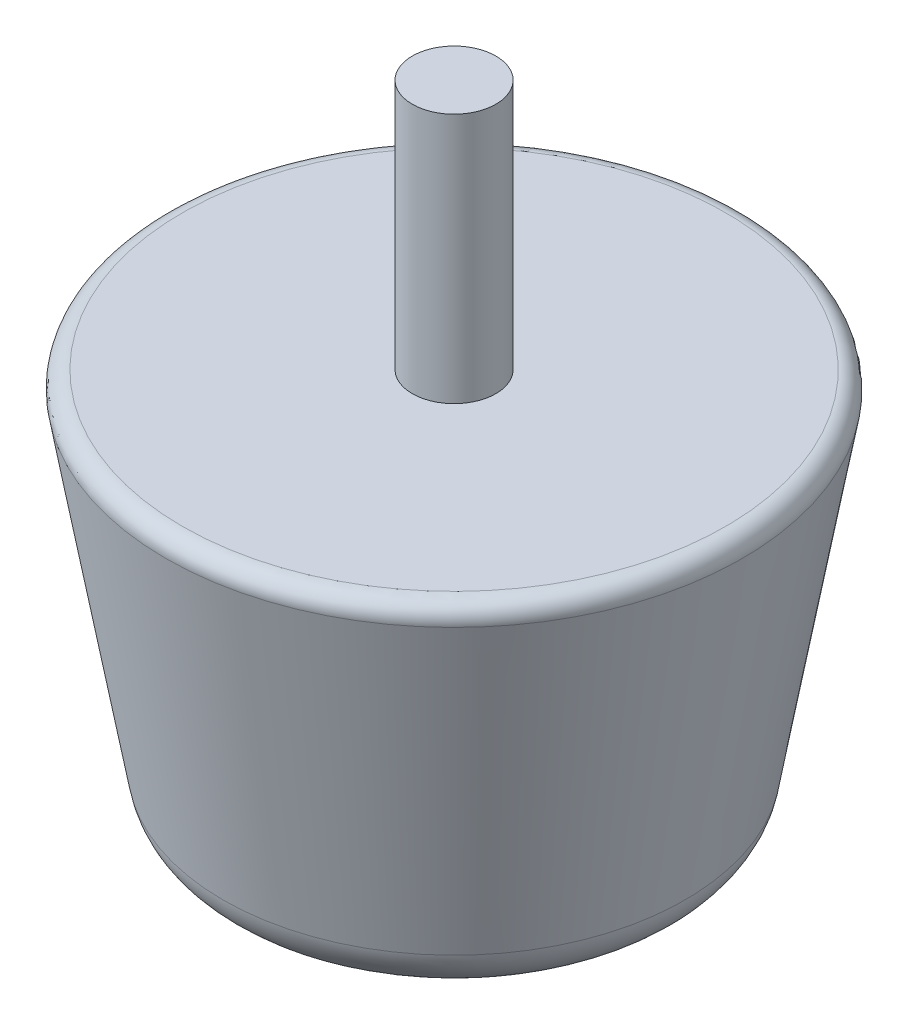
ISO-10303-21;
HEADER;
FILE_DESCRIPTION(('STEP AP214'),'2;1');
FILE_NAME('part.step','',(''),(''),'','','');
FILE_SCHEMA(('AUTOMOTIVE_DESIGN { 1 0 10303 214 1 1 1 1 }'));
ENDSEC;
DATA;
#1=APPLICATION_CONTEXT('core data for automotive mechanical design processes');
#2=APPLICATION_PROTOCOL_DEFINITION('international standard','automotive_design',2000,#1);
#3=PRODUCT_CONTEXT('',#1,'mechanical');
#4=PRODUCT('Part','Part','',(#3));
#5=PRODUCT_RELATED_PRODUCT_CATEGORY('part','',(#4));
#6=PRODUCT_DEFINITION_FORMATION('','',#4);
#7=PRODUCT_DEFINITION_CONTEXT('part definition',#1,'design');
#8=PRODUCT_DEFINITION('design','',#6,#7);
#9=PRODUCT_DEFINITION_SHAPE('','',#8);
#10=(LENGTH_UNIT() NAMED_UNIT(*) SI_UNIT(.MILLI.,.METRE.));
#11=(NAMED_UNIT(*) PLANE_ANGLE_UNIT() SI_UNIT($,.RADIAN.));
#12=(NAMED_UNIT(*) SI_UNIT($,.STERADIAN.) SOLID_ANGLE_UNIT());
#13=UNCERTAINTY_MEASURE_WITH_UNIT(LENGTH_MEASURE(1.E-05),#10,'distance_accuracy_value','');
#14=(GEOMETRIC_REPRESENTATION_CONTEXT(3) GLOBAL_UNCERTAINTY_ASSIGNED_CONTEXT((#13)) GLOBAL_UNIT_ASSIGNED_CONTEXT((#10,
#11,#12)) REPRESENTATION_CONTEXT('',''));
#15=CARTESIAN_POINT('',(0.,0.,0.));
#16=DIRECTION('',(0.,0.,1.));
#17=DIRECTION('',(1.,0.,0.));
#18=AXIS2_PLACEMENT_3D('',#15,#16,#17);
#19=CARTESIAN_POINT('',(0.,0.,0.));
#20=DIRECTION('',(0.,1.,0.));
#21=DIRECTION('',(0.,0.,1.));
#22=AXIS2_PLACEMENT_3D('',#19,#20,#21);
#23=CONICAL_SURFACE('',#22,40.,0.174532925199433);
#24=CARTESIAN_POINT('',(0.,66.4790554669992,0.));
#25=DIRECTION('',(0.,1.,0.));
#26=DIRECTION('',(0.,0.,1.));
#27=AXIS2_PLACEMENT_3D('',#24,#25,#26);
#28=CIRCLE('',#27,51.7220511308465);
#29=CARTESIAN_POINT('',(0.,66.4790554669992,51.7220511308465));
#30=VERTEX_POINT('',#29);
#31=EDGE_CURVE('E10',#30,#30,#28,.F.);
#32=ORIENTED_EDGE('',*,*,#31,.T.);
#33=EDGE_LOOP('',(#32));
#34=FACE_BOUND('',#33,.T.);
#35=CARTESIAN_POINT('',(0.,8.26351822333068,0.));
#36=DIRECTION('',(0.,-1.,0.));
#37=DIRECTION('',(0.,0.,-1.));
#38=AXIS2_PLACEMENT_3D('',#35,#36,#37);
#39=CIRCLE('',#38,41.4570812183493);
#40=CARTESIAN_POINT('',(0.,8.26351822333068,-41.4570812183493));
#41=VERTEX_POINT('',#40);
#42=EDGE_CURVE('E48',#41,#41,#39,.F.);
#43=ORIENTED_EDGE('',*,*,#42,.T.);
#44=EDGE_LOOP('',(#43));
#45=FACE_BOUND('',#44,.T.);
#46=CARTESIAN_POINT('',(-45.8974561002225,35.9488089682655,-6.37987512782607));
#47=CARTESIAN_POINT('',(-45.8903514142707,35.769928031762,-6.20189333521978));
#48=CARTESIAN_POINT('',(-45.8846228311216,35.5985513842555,-6.01639155035223));
#49=CARTESIAN_POINT('',(-45.8754159511401,35.2719126647508,-5.63155509444685));
#50=CARTESIAN_POINT('',(-45.8719381022997,35.1166538060377,-5.43221767826768));
#51=CARTESIAN_POINT('',(-45.8667348880702,34.8233154550655,-5.02101952539878));
#52=CARTESIAN_POINT('',(-45.8650109720066,34.6852502529545,-4.80914858460226));
#53=CARTESIAN_POINT('',(-45.8628353063316,34.4274271037308,-4.37453493287493));
#54=CARTESIAN_POINT('',(-45.8623835729308,34.3076693899172,-4.1517920834471));
#55=CARTESIAN_POINT('',(-45.8623017406117,34.0873766555292,-3.69714495858653));
#56=CARTESIAN_POINT('',(-45.8626711982514,33.9868312921531,-3.4652456940292));
#57=CARTESIAN_POINT('',(-45.8638314727603,33.8055935775401,-2.99381294864866));
#58=CARTESIAN_POINT('',(-45.8646222942675,33.7249014448443,-2.75427938382107));
#59=CARTESIAN_POINT('',(-45.8662905447548,33.5839691540764,-2.26936699004312));
#60=CARTESIAN_POINT('',(-45.8671679412458,33.5237213612054,-2.02399037985416));
#61=CARTESIAN_POINT('',(-45.8687522817933,33.4240449582834,-1.52895543413469));
#62=CARTESIAN_POINT('',(-45.8694591667411,33.3846235621911,-1.27929564585051));
#63=CARTESIAN_POINT('',(-45.8705307017393,33.3268565305042,-0.777070797355823));
#64=CARTESIAN_POINT('',(-45.870894703243,33.3085508195416,-0.524501142555404));
#65=CARTESIAN_POINT('',(-45.8711967935054,33.2932798876374,-0.0187168572044999));
#66=CARTESIAN_POINT('',(-45.8711348814271,33.2963147086415,0.234497774612731));
#67=CARTESIAN_POINT('',(-45.8705986726555,33.3237035949045,0.739776440757387));
#68=CARTESIAN_POINT('',(-45.8701243670717,33.3480581197884,0.991840450161136));
#69=CARTESIAN_POINT('',(-45.8688712984262,33.4179146705308,1.4930270841764));
#70=CARTESIAN_POINT('',(-45.8680925269878,33.4634172782382,1.74214962766575));
#71=CARTESIAN_POINT('',(-45.8664293022167,33.5752414004759,2.23565268716838));
#72=CARTESIAN_POINT('',(-45.8655448587494,33.6415609724955,2.48003364337901));
#73=CARTESIAN_POINT('',(-45.8639527494806,33.7945470795368,2.96233454989759));
#74=CARTESIAN_POINT('',(-45.8632450786204,33.8812130321593,3.20025468492405));
#75=CARTESIAN_POINT('',(-45.8623629587414,34.0742804763686,3.6679581195617));
#76=CARTESIAN_POINT('',(-45.8621885265835,34.1806825918921,3.89774116165422));
#77=CARTESIAN_POINT('',(-45.8627909109035,34.4124632122493,4.34752663878387));
#78=CARTESIAN_POINT('',(-45.863567723556,34.5378416407658,4.56752911315103));
#79=CARTESIAN_POINT('',(-45.866537048813,34.8066902088615,4.99620155158313));
#80=CARTESIAN_POINT('',(-45.8687296691272,34.9501617242307,5.2048706521354));
#81=CARTESIAN_POINT('',(-45.8750230378274,35.2541004204664,5.60928834527643));
#82=CARTESIAN_POINT('',(-45.8791230678286,35.4145611851385,5.80504177061001));
#83=CARTESIAN_POINT('',(-45.8897345720545,35.7513846507814,6.18233675634842));
#84=CARTESIAN_POINT('',(-45.8962464041637,35.9277497088315,6.36387620271218));
#85=CARTESIAN_POINT('',(-45.9121736731263,36.2950678213194,6.71140387256858));
#86=CARTESIAN_POINT('',(-45.9215890942489,36.4860207967202,6.87739218030616));
#87=CARTESIAN_POINT('',(-45.9437262707912,36.8800784158394,7.19181209453772));
#88=CARTESIAN_POINT('',(-45.9564307196313,37.0831152926141,7.34032985174292));
#89=CARTESIAN_POINT('',(-45.9855691556515,37.500717201811,7.61974747462699));
#90=CARTESIAN_POINT('',(-46.0020031276112,37.7152821871835,7.75064741220206));
#91=CARTESIAN_POINT('',(-46.0389280542005,38.1543183168253,7.99391591110991));
#92=CARTESIAN_POINT('',(-46.0594187167475,38.3787887469968,8.10628580554266));
#93=CARTESIAN_POINT('',(-46.104697622058,38.8359627595581,8.31175678427947));
#94=CARTESIAN_POINT('',(-46.129485847132,39.0686663080559,8.40485794789328));
#95=CARTESIAN_POINT('',(-46.1833148704562,39.5389674936952,8.57064876774292));
#96=CARTESIAN_POINT('',(-46.2123258414896,39.7765215055597,8.64347193022743));
#97=CARTESIAN_POINT('',(-46.2747490201945,40.2562869817818,8.76913524887538));
#98=CARTESIAN_POINT('',(-46.3081611993136,40.4984984159162,8.82197553466674));
#99=CARTESIAN_POINT('',(-46.3792954662731,40.9857938142128,8.90743523162322));
#100=CARTESIAN_POINT('',(-46.4170168658507,41.2308773140567,8.94005786659067));
#101=CARTESIAN_POINT('',(-46.4965921953376,41.7223204340153,8.98503559020163));
#102=CARTESIAN_POINT('',(-46.5384476686118,41.9686804979363,8.99738307901651));
#103=CARTESIAN_POINT('',(-46.6264142197458,42.463356203862,9.00189171154719));
#104=CARTESIAN_POINT('',(-46.6725635564519,42.7116668623964,8.99385042415932));
#105=CARTESIAN_POINT('',(-46.7683642977407,43.2061938886507,8.95737288395813));
#106=CARTESIAN_POINT('',(-46.8180169797143,43.4524094554056,8.92892915698891));
#107=CARTESIAN_POINT('',(-46.920297946936,43.9409984145933,8.85199475474628));
#108=CARTESIAN_POINT('',(-46.9729255675674,44.1833726498289,8.80350854190837));
#109=CARTESIAN_POINT('',(-47.0806102561915,44.6629011493776,8.68691849244843));
#110=CARTESIAN_POINT('',(-47.1356682470228,44.9000533787072,8.61880714873318));
#111=CARTESIAN_POINT('',(-47.2493059145538,45.3749118495865,8.46107903716087));
#112=CARTESIAN_POINT('',(-47.3079418781172,45.6124034953579,8.37085635953464));
#113=CARTESIAN_POINT('',(-47.4263630133958,46.0787865322759,8.17074786242679));
#114=CARTESIAN_POINT('',(-47.4861486994376,46.3076739323621,8.06085305098553));
#115=CARTESIAN_POINT('',(-47.6060466760404,46.7553320290342,7.82214745000627));
#116=CARTESIAN_POINT('',(-47.6661590258102,46.9741008182689,7.69333311310465));
#117=CARTESIAN_POINT('',(-47.785827834406,47.3999865747197,7.41767918119029));
#118=CARTESIAN_POINT('',(-47.8453845260436,47.6071086231341,7.27084753708598));
#119=CARTESIAN_POINT('',(-47.9645221424168,48.0133021727708,6.95624587621774));
#120=CARTESIAN_POINT('',(-48.0240689952911,48.2120589470591,6.78805621084002));
#121=CARTESIAN_POINT('',(-48.1407259564724,48.594557240679,6.43476563406044));
#122=CARTESIAN_POINT('',(-48.1978369983242,48.7783045376833,6.24967128852915));
#123=CARTESIAN_POINT('',(-48.3087180057107,49.1295590489613,5.86359571894525));
#124=CARTESIAN_POINT('',(-48.362486684683,49.2970600233344,5.66260844410238));
#125=CARTESIAN_POINT('',(-48.4656977304076,49.6143295779788,5.24618698162293));
#126=CARTESIAN_POINT('',(-48.5151419752442,49.7641058660889,5.03075913799497));
#127=CARTESIAN_POINT('',(-48.6079469712588,50.0420930477672,4.59097835659671));
#128=CARTESIAN_POINT('',(-48.6514042180443,50.1706549310639,4.36686774905923));
#129=CARTESIAN_POINT('',(-48.7324822169639,50.4083435473385,3.90767507600775));
#130=CARTESIAN_POINT('',(-48.7701055542724,50.517478891969,3.67259793050525));
#131=CARTESIAN_POINT('',(-48.8388053472719,50.7153299515976,3.1930990031879));
#132=CARTESIAN_POINT('',(-48.8698824467359,50.804047674594,2.9486781430525));
#133=CARTESIAN_POINT('',(-48.9248645719362,50.9601704515743,2.45233773444084));
#134=CARTESIAN_POINT('',(-48.9487699593866,51.027576580444,2.20041856485574));
#135=CARTESIAN_POINT('',(-48.9878413294669,51.1373552032242,1.70465712970986));
#136=CARTESIAN_POINT('',(-49.0034046456209,51.1808688700417,1.46109833134884));
#137=CARTESIAN_POINT('',(-49.0273561720327,51.247714322951,0.970879543670583));
#138=CARTESIAN_POINT('',(-49.035744648135,51.2710468568011,0.724219669599079));
#139=CARTESIAN_POINT('',(-49.0451813732922,51.2972891968117,0.229727200491343));
#140=CARTESIAN_POINT('',(-49.0462311296065,51.3002031966233,-0.0181051432736649));
#141=CARTESIAN_POINT('',(-49.0409735859176,51.2855892112619,-0.513086254831176));
#142=CARTESIAN_POINT('',(-49.0346664014755,51.2680615471815,-0.760235033299828));
#143=CARTESIAN_POINT('',(-49.0151773618636,51.2137429678976,-1.2431029992945));
#144=CARTESIAN_POINT('',(-49.002251018414,51.1776678239884,-1.47891347791836));
#145=CARTESIAN_POINT('',(-48.9699052235514,51.0870132318688,-1.94658293988985));
#146=CARTESIAN_POINT('',(-48.9504834697493,51.032427222127,-2.17844049139623));
#147=CARTESIAN_POINT('',(-48.9054947889027,50.9052615801361,-2.63650437545279));
#148=CARTESIAN_POINT('',(-48.8799289957146,50.8326852678431,-2.86271174222727));
#149=CARTESIAN_POINT('',(-48.8230869333507,50.6701610901623,-3.30806375305191));
#150=CARTESIAN_POINT('',(-48.7918103637822,50.5802123109503,-3.5272080248622));
#151=CARTESIAN_POINT('',(-48.7235320024675,50.3821420973028,-3.96044453804275));
#152=CARTESIAN_POINT('',(-48.6864480517543,50.2737575807988,-4.17440349008854));
#153=CARTESIAN_POINT('',(-48.6075286705465,50.0406968583459,-4.59233719419268));
#154=CARTESIAN_POINT('',(-48.5656931030421,49.9160201826074,-4.79631165811184));
#155=CARTESIAN_POINT('',(-48.4779257318314,49.6513073550324,-5.1931048572222));
#156=CARTESIAN_POINT('',(-48.4319938667161,49.5112709729258,-5.38592342509996));
#157=CARTESIAN_POINT('',(-48.3367071054995,49.2167731217232,-5.75940721588838));
#158=CARTESIAN_POINT('',(-48.2873510614239,49.0623068088432,-5.94006832256637));
#159=CARTESIAN_POINT('',(-48.183355790846,48.7317986693752,-6.29707372339959));
#160=CARTESIAN_POINT('',(-48.1285755362986,48.5550591515626,-6.47273143245397));
#161=CARTESIAN_POINT('',(-48.0168586889689,48.188011872343,-6.80850087877895));
#162=CARTESIAN_POINT('',(-47.9599220073745,47.9977035518215,-6.96861197479491));
#163=CARTESIAN_POINT('',(-47.8446988617516,47.6046826719607,-7.27243190266121));
#164=CARTESIAN_POINT('',(-47.7864119077565,47.4019655646574,-7.41613466470374));
#165=CARTESIAN_POINT('',(-47.6693406645787,46.985520347603,-7.68619713508412));
#166=CARTESIAN_POINT('',(-47.6105565253775,46.771795465946,-7.81256188851263));
#167=CARTESIAN_POINT('',(-47.4908278486114,46.325498374722,-8.05211085189159));
#168=CARTESIAN_POINT('',(-47.4298949028055,46.0925120857474,-8.16453037397656));
#169=CARTESIAN_POINT('',(-47.3091846796956,45.6174750962189,-8.36899584095719));
#170=CARTESIAN_POINT('',(-47.2494074096512,45.3754243387534,-8.46104165791074));
#171=CARTESIAN_POINT('',(-47.1318124356856,44.8838511866916,-8.62405370578498));
#172=CARTESIAN_POINT('',(-47.0739947815839,44.6343286024416,-8.69501940113918));
#173=CARTESIAN_POINT('',(-46.9610653855728,44.1295143528488,-8.81524446585442));
#174=CARTESIAN_POINT('',(-46.9059535338164,43.8742229223184,-8.86450471703692));
#175=CARTESIAN_POINT('',(-46.7991933671373,43.3601065750519,-8.9407393706553));
#176=CARTESIAN_POINT('',(-46.7475389619368,43.101288892783,-8.96775396147848));
#177=CARTESIAN_POINT('',(-46.6481690353078,42.5816312165141,-8.99925612517496));
#178=CARTESIAN_POINT('',(-46.6004520195229,42.320792031234,-9.00375228350003));
#179=CARTESIAN_POINT('',(-46.5093806058819,41.7988916928987,-8.99000699668448));
#180=CARTESIAN_POINT('',(-46.4660270863931,41.5378305057779,-8.9717609834223));
#181=CARTESIAN_POINT('',(-46.3840255970083,41.0175687309552,-8.91246690466168));
#182=CARTESIAN_POINT('',(-46.3453774292039,40.7583680654309,-8.87141979858786));
#183=CARTESIAN_POINT('',(-46.2741480566061,40.2521915840902,-8.76835525547098));
#184=CARTESIAN_POINT('',(-46.2414113972634,40.0050910910807,-8.70705674700625));
#185=CARTESIAN_POINT('',(-46.1805768379421,39.5164586296844,-8.56355358463773));
#186=CARTESIAN_POINT('',(-46.1524787753533,39.2749264663503,-8.4813496638487));
#187=CARTESIAN_POINT('',(-46.1008707766185,38.7994978490752,-8.29661001764855));
#188=CARTESIAN_POINT('',(-46.0773568494005,38.5655949020311,-8.19409213636467));
#189=CARTESIAN_POINT('',(-46.0347028432187,38.1071000332473,-7.9694085924648));
#190=CARTESIAN_POINT('',(-46.0155618672502,37.8825062097183,-7.84724696806083));
#191=CARTESIAN_POINT('',(-45.9741891621458,37.3524567581588,-7.52892650761931));
#192=CARTESIAN_POINT('',(-45.9540194584909,37.0525221190408,-7.32320230470387));
#193=CARTESIAN_POINT('',(-45.9207676793008,36.4794759116237,-6.87680662681361));
#194=CARTESIAN_POINT('',(-45.9076855174557,36.2063640167188,-6.63613557745559));
#195=CARTESIAN_POINT('',(-45.8974561002225,35.9488089682655,-6.37987512782607));
#196=B_SPLINE_CURVE_WITH_KNOTS('',3,(#46,#47,#48,#49,#50,#51,#52,#53,#54,#55,#56,#57,#58,#59,
#60,#61,#62,#63,#64,#65,#66,#67,#68,#69,#70,#71,#72,#73,#74,#75,#76,#77,#78,#79,#80,#81,#82,#83,
#84,#85,#86,#87,#88,#89,#90,#91,#92,#93,#94,#95,#96,#97,#98,#99,#100,#101,#102,#103,#104,#105,
#106,#107,#108,#109,#110,#111,#112,#113,#114,#115,#116,#117,#118,#119,#120,#121,#122,#123,#124,
#125,#126,#127,#128,#129,#130,#131,#132,#133,#134,#135,#136,#137,#138,#139,#140,#141,#142,#143,
#144,#145,#146,#147,#148,#149,#150,#151,#152,#153,#154,#155,#156,#157,#158,#159,#160,#161,#162,
#163,#164,#165,#166,#167,#168,#169,#170,#171,#172,#173,#174,#175,#176,#177,#178,#179,#180,#181,
#182,#183,#184,#185,#186,#187,#188,#189,#190,#191,#192,#193,#194,#195),.UNSPECIFIED.,.T.,.F.,(4,
2,2,2,2,2,2,2,2,2,2,2,2,2,2,2,2,2,2,2,2,2,2,2,2,2,2,2,2,2,2,2,2,2,2,2,2,2,2,2,2,2,2,2,2,2,2,2,2,
2,2,2,2,2,2,2,2,2,2,2,2,2,2,2,2,2,2,2,2,2,2,2,2,2,4),(0.,0.757003399972339,1.51415742948407,
2.27193661036846,3.02972544710741,3.78710517833768,4.54449324631055,5.30159816082264,
6.05896515372429,6.81776180846524,7.57655995464806,8.33537445992597,9.09420984376334,
9.85297443880329,10.6117173174483,11.3704841869896,12.1292480050688,12.8880695540296,
13.6466055402734,14.4052541298984,15.1638986094706,15.9186295526888,16.6733574158475,
17.4280309581906,18.1827013942488,18.9322789672923,19.6818516777805,20.4313048344972,
21.1810388482009,21.9382457246096,22.6957301352084,23.4530459835723,24.2106519092671,
24.991949723299,25.7736055778683,26.5554081784902,27.3368670076653,28.1371767646993,
28.937176988358,29.7374832700083,30.5374402378544,31.3224333939036,32.1070776964878,
32.891644799174,33.6761723245984,34.4189559995878,35.1617121515189,35.9043157483527,
36.6469076807131,37.3627815569878,38.0789094541988,38.7949052944062,39.5109388075925,
40.2382113810899,40.9655049303579,41.6928093845736,42.4203588608816,43.1849021661138,
43.9494769932509,44.7143337435429,45.4789674582682,46.2753355272266,47.0717085970485,
47.8681018979799,48.6644628410628,49.4593819247914,50.2539979119672,51.0487735359421,
51.8435157198733,52.6126293578702,53.3817160281697,54.15013009091,54.9183863903762,
56.0083427911847,57.0982859185534),.UNSPECIFIED.);
#197=CARTESIAN_POINT('',(-45.8974561002225,35.9488089682655,-6.37987512782607));
#198=VERTEX_POINT('',#197);
#199=EDGE_CURVE('E53',#198,#198,#196,.T.);
#200=ORIENTED_EDGE('',*,*,#199,.F.);
#201=EDGE_LOOP('',(#200));
#202=FACE_BOUND('',#201,.T.);
#203=ADVANCED_FACE('F33',(#34,#45,#202),#23,.T.);
#204=CARTESIAN_POINT('',(0.,70.,0.));
#205=DIRECTION('',(0.,1.,0.));
#206=DIRECTION('',(0.,0.,1.));
#207=AXIS2_PLACEMENT_3D('',#204,#205,#206);
#208=PLANE('',#207);
#209=CARTESIAN_POINT('',(0.,70.,0.));
#210=DIRECTION('',(0.,1.,0.));
#211=DIRECTION('',(0.,0.,1.));
#212=AXIS2_PLACEMENT_3D('',#209,#210,#211);
#213=CIRCLE('',#212,48.7676278718099);
#214=CARTESIAN_POINT('',(0.,70.,48.7676278718099));
#215=VERTEX_POINT('',#214);
#216=EDGE_CURVE('E40',#215,#215,#213,.T.);
#217=ORIENTED_EDGE('',*,*,#216,.T.);
#218=EDGE_LOOP('',(#217));
#219=FACE_BOUND('',#218,.T.);
#220=CARTESIAN_POINT('',(0.,70.,0.));
#221=DIRECTION('',(0.,1.,0.));
#222=DIRECTION('',(0.,0.,1.));
#223=AXIS2_PLACEMENT_3D('',#220,#221,#222);
#224=CIRCLE('',#223,7.5);
#225=CARTESIAN_POINT('',(0.,70.,7.5));
#226=VERTEX_POINT('',#225);
#227=EDGE_CURVE('E159',#226,#226,#224,.T.);
#228=ORIENTED_EDGE('',*,*,#227,.F.);
#229=EDGE_LOOP('',(#228));
#230=FACE_BOUND('',#229,.T.);
#231=ADVANCED_FACE('F84',(#219,#230),#208,.T.);
#232=CARTESIAN_POINT('',(0.,0.,0.));
#233=DIRECTION('',(0.,1.,0.));
#234=DIRECTION('',(0.,0.,1.));
#235=AXIS2_PLACEMENT_3D('',#232,#233,#234);
#236=PLANE('',#235);
#237=CARTESIAN_POINT('',(0.,0.,0.));
#238=DIRECTION('',(0.,1.,0.));
#239=DIRECTION('',(0.,0.,1.));
#240=AXIS2_PLACEMENT_3D('',#237,#238,#239);
#241=CIRCLE('',#240,31.6090036882272);
#242=CARTESIAN_POINT('',(0.,0.,31.6090036882272));
#243=VERTEX_POINT('',#242);
#244=EDGE_CURVE('E44',#243,#243,#241,.F.);
#245=ORIENTED_EDGE('',*,*,#244,.T.);
#246=EDGE_LOOP('',(#245));
#247=FACE_BOUND('',#246,.T.);
#248=ADVANCED_FACE('F80',(#247),#236,.F.);
#249=CARTESIAN_POINT('',(-52.3438886495925,42.2968160061748,0.));
#250=DIRECTION('',(1.,0.,0.));
#251=DIRECTION('',(0.,0.,-1.));
#252=AXIS2_PLACEMENT_3D('',#249,#250,#251);
#253=CYLINDRICAL_SURFACE('',#252,9.);
#254=CARTESIAN_POINT('',(-45.,42.2968160061748,0.));
#255=DIRECTION('',(1.,0.,0.));
#256=DIRECTION('',(0.,0.,-1.));
#257=AXIS2_PLACEMENT_3D('',#254,#255,#256);
#258=CIRCLE('',#257,9.);
#259=CARTESIAN_POINT('',(-45.,42.2968160061748,-9.));
#260=VERTEX_POINT('',#259);
#261=EDGE_CURVE('E61',#260,#260,#258,.T.);
#262=ORIENTED_EDGE('',*,*,#261,.T.);
#263=EDGE_LOOP('',(#262));
#264=FACE_BOUND('',#263,.T.);
#265=ORIENTED_EDGE('',*,*,#199,.T.);
#266=EDGE_LOOP('',(#265));
#267=FACE_BOUND('',#266,.T.);
#268=ADVANCED_FACE('F63',(#264,#267),#253,.F.);
#269=CARTESIAN_POINT('',(-45.,42.2968160061748,0.));
#270=DIRECTION('',(1.,0.,0.));
#271=DIRECTION('',(0.,0.,-1.));
#272=AXIS2_PLACEMENT_3D('',#269,#270,#271);
#273=PLANE('',#272);
#274=ORIENTED_EDGE('',*,*,#261,.F.);
#275=EDGE_LOOP('',(#274));
#276=FACE_BOUND('',#275,.T.);
#277=ADVANCED_FACE('F71',(#276),#273,.F.);
#278=CARTESIAN_POINT('',(0.,115.,0.));
#279=DIRECTION('',(0.,-1.,0.));
#280=DIRECTION('',(0.,0.,-1.));
#281=AXIS2_PLACEMENT_3D('',#278,#279,#280);
#282=CYLINDRICAL_SURFACE('',#281,7.5);
#283=CARTESIAN_POINT('',(0.,115.,0.));
#284=DIRECTION('',(0.,1.,0.));
#285=DIRECTION('',(0.,0.,1.));
#286=AXIS2_PLACEMENT_3D('',#283,#284,#285);
#287=CIRCLE('',#286,7.5);
#288=CARTESIAN_POINT('',(0.,115.,7.5));
#289=VERTEX_POINT('',#288);
#290=EDGE_CURVE('E158',#289,#289,#287,.T.);
#291=ORIENTED_EDGE('',*,*,#290,.F.);
#292=EDGE_LOOP('',(#291));
#293=FACE_BOUND('',#292,.T.);
#294=ORIENTED_EDGE('',*,*,#227,.T.);
#295=EDGE_LOOP('',(#294));
#296=FACE_BOUND('',#295,.T.);
#297=ADVANCED_FACE('F69',(#293,#296),#282,.T.);
#298=CARTESIAN_POINT('',(0.,115.,0.));
#299=DIRECTION('',(0.,1.,0.));
#300=DIRECTION('',(0.,0.,1.));
#301=AXIS2_PLACEMENT_3D('',#298,#299,#300);
#302=PLANE('',#301);
#303=ORIENTED_EDGE('',*,*,#290,.T.);
#304=EDGE_LOOP('',(#303));
#305=FACE_BOUND('',#304,.T.);
#306=ADVANCED_FACE('F78',(#305),#302,.T.);
#307=CARTESIAN_POINT('',(0.,10.,0.));
#308=DIRECTION('',(0.,1.,0.));
#309=DIRECTION('',(0.,0.,1.));
#310=AXIS2_PLACEMENT_3D('',#307,#308,#309);
#311=TOROIDAL_SURFACE('',#310,31.6090036882272,10.);
#312=ORIENTED_EDGE('',*,*,#244,.F.);
#313=EDGE_LOOP('',(#312));
#314=FACE_BOUND('',#313,.T.);
#315=ORIENTED_EDGE('',*,*,#42,.F.);
#316=EDGE_LOOP('',(#315));
#317=FACE_BOUND('',#316,.T.);
#318=ADVANCED_FACE('F91',(#314,#317),#311,.T.);
#319=CARTESIAN_POINT('',(0.,67.,0.));
#320=DIRECTION('',(0.,1.,0.));
#321=DIRECTION('',(0.,0.,1.));
#322=AXIS2_PLACEMENT_3D('',#319,#320,#321);
#323=TOROIDAL_SURFACE('',#322,48.7676278718099,3.);
#324=ORIENTED_EDGE('',*,*,#31,.F.);
#325=EDGE_LOOP('',(#324));
#326=FACE_BOUND('',#325,.T.);
#327=ORIENTED_EDGE('',*,*,#216,.F.);
#328=EDGE_LOOP('',(#327));
#329=FACE_BOUND('',#328,.T.);
#330=ADVANCED_FACE('F35',(#326,#329),#323,.T.);
#331=CLOSED_SHELL('',(#203,#231,#248,#268,#277,#297,#306,#318,#330));
#332=MANIFOLD_SOLID_BREP('B2',#331);
#333=ADVANCED_BREP_SHAPE_REPRESENTATION('',(#18,#332),#14);
#334=SHAPE_DEFINITION_REPRESENTATION(#9,#333);
ENDSEC;
END-ISO-10303-21;
